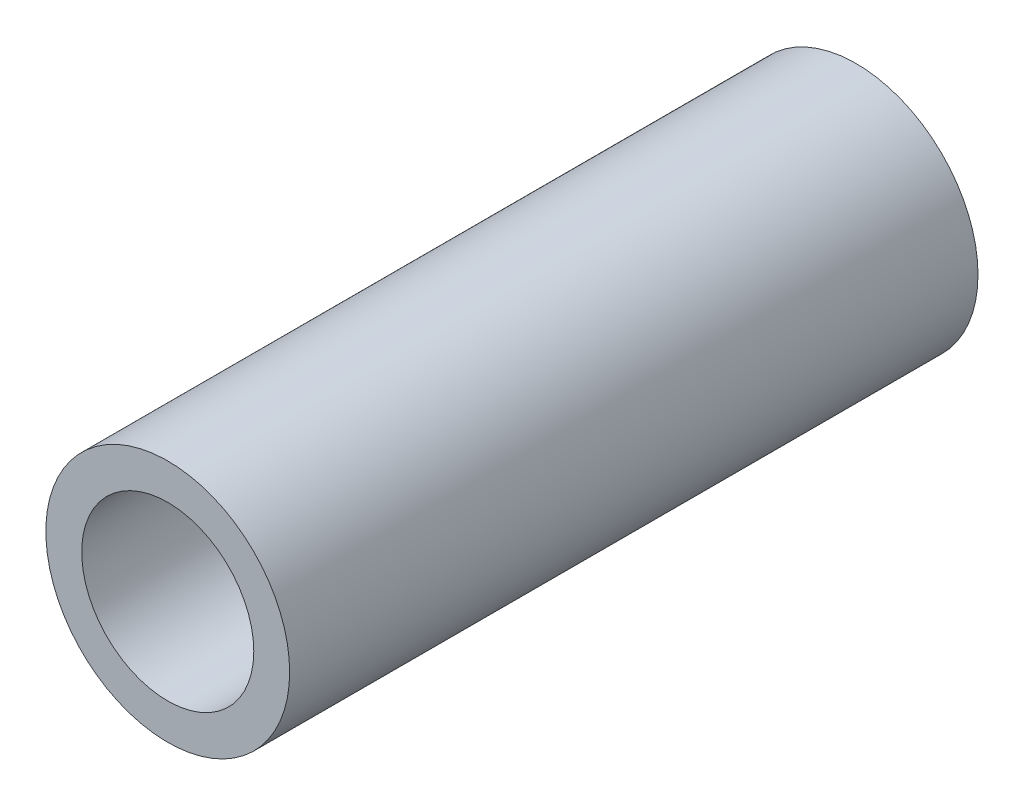
ISO-10303-21;
HEADER;
FILE_DESCRIPTION(('STEP AP214'),'2;1');
FILE_NAME('part.step','',(''),(''),'','','');
FILE_SCHEMA(('AUTOMOTIVE_DESIGN { 1 0 10303 214 1 1 1 1 }'));
ENDSEC;
DATA;
#1=APPLICATION_CONTEXT('core data for automotive mechanical design processes');
#2=APPLICATION_PROTOCOL_DEFINITION('international standard','automotive_design',2000,#1);
#3=PRODUCT_CONTEXT('',#1,'mechanical');
#4=PRODUCT('Part','Part','',(#3));
#5=PRODUCT_RELATED_PRODUCT_CATEGORY('part','',(#4));
#6=PRODUCT_DEFINITION_FORMATION('','',#4);
#7=PRODUCT_DEFINITION_CONTEXT('part definition',#1,'design');
#8=PRODUCT_DEFINITION('design','',#6,#7);
#9=PRODUCT_DEFINITION_SHAPE('','',#8);
#10=(LENGTH_UNIT() NAMED_UNIT(*) SI_UNIT(.MILLI.,.METRE.));
#11=(NAMED_UNIT(*) PLANE_ANGLE_UNIT() SI_UNIT($,.RADIAN.));
#12=(NAMED_UNIT(*) SI_UNIT($,.STERADIAN.) SOLID_ANGLE_UNIT());
#13=UNCERTAINTY_MEASURE_WITH_UNIT(LENGTH_MEASURE(1.E-05),#10,'distance_accuracy_value','');
#14=(GEOMETRIC_REPRESENTATION_CONTEXT(3) GLOBAL_UNCERTAINTY_ASSIGNED_CONTEXT((#13)) GLOBAL_UNIT_ASSIGNED_CONTEXT((#10,
#11,#12)) REPRESENTATION_CONTEXT('',''));
#15=CARTESIAN_POINT('',(0.,0.,0.));
#16=DIRECTION('',(0.,0.,1.));
#17=DIRECTION('',(1.,0.,0.));
#18=AXIS2_PLACEMENT_3D('',#15,#16,#17);
#19=CARTESIAN_POINT('',(0.,0.,0.));
#20=DIRECTION('',(0.,0.,1.));
#21=DIRECTION('',(1.,0.,0.));
#22=AXIS2_PLACEMENT_3D('',#19,#20,#21);
#23=PLANE('',#22);
#24=CARTESIAN_POINT('',(0.,0.,0.));
#25=DIRECTION('',(0.,0.,1.));
#26=DIRECTION('',(1.,0.,0.));
#27=AXIS2_PLACEMENT_3D('',#24,#25,#26);
#28=CIRCLE('',#27,9.525);
#29=CARTESIAN_POINT('',(9.525,0.,0.));
#30=VERTEX_POINT('',#29);
#31=EDGE_CURVE('E62',#30,#30,#28,.F.);
#32=ORIENTED_EDGE('',*,*,#31,.F.);
#33=EDGE_LOOP('',(#32));
#34=FACE_BOUND('',#33,.T.);
#35=CARTESIAN_POINT('',(0.,0.,0.));
#36=DIRECTION('',(0.,0.,1.));
#37=DIRECTION('',(1.,0.,0.));
#38=AXIS2_PLACEMENT_3D('',#35,#36,#37);
#39=CIRCLE('',#38,13.49375);
#40=CARTESIAN_POINT('',(13.49375,0.,0.));
#41=VERTEX_POINT('',#40);
#42=EDGE_CURVE('E54',#41,#41,#39,.T.);
#43=ORIENTED_EDGE('',*,*,#42,.F.);
#44=EDGE_LOOP('',(#43));
#45=FACE_BOUND('',#44,.T.);
#46=ADVANCED_FACE('F48',(#34,#45),#23,.F.);
#47=CARTESIAN_POINT('',(0.,0.,76.2));
#48=DIRECTION('',(0.,0.,1.));
#49=DIRECTION('',(1.,0.,0.));
#50=AXIS2_PLACEMENT_3D('',#47,#48,#49);
#51=PLANE('',#50);
#52=CARTESIAN_POINT('',(0.,0.,76.2));
#53=DIRECTION('',(0.,0.,1.));
#54=DIRECTION('',(1.,0.,0.));
#55=AXIS2_PLACEMENT_3D('',#52,#53,#54);
#56=CIRCLE('',#55,9.525);
#57=CARTESIAN_POINT('',(9.525,0.,76.2));
#58=VERTEX_POINT('',#57);
#59=EDGE_CURVE('E58',#58,#58,#56,.F.);
#60=ORIENTED_EDGE('',*,*,#59,.T.);
#61=EDGE_LOOP('',(#60));
#62=FACE_BOUND('',#61,.T.);
#63=CARTESIAN_POINT('',(0.,0.,76.2));
#64=DIRECTION('',(0.,0.,1.));
#65=DIRECTION('',(1.,0.,0.));
#66=AXIS2_PLACEMENT_3D('',#63,#64,#65);
#67=CIRCLE('',#66,13.49375);
#68=CARTESIAN_POINT('',(13.49375,0.,76.2));
#69=VERTEX_POINT('',#68);
#70=EDGE_CURVE('E11',#69,#69,#67,.T.);
#71=ORIENTED_EDGE('',*,*,#70,.T.);
#72=EDGE_LOOP('',(#71));
#73=FACE_BOUND('',#72,.T.);
#74=ADVANCED_FACE('F73',(#62,#73),#51,.T.);
#75=CARTESIAN_POINT('',(0.,0.,0.));
#76=DIRECTION('',(0.,0.,1.));
#77=DIRECTION('',(1.,0.,0.));
#78=AXIS2_PLACEMENT_3D('',#75,#76,#77);
#79=CYLINDRICAL_SURFACE('',#78,13.49375);
#80=ORIENTED_EDGE('',*,*,#70,.F.);
#81=EDGE_LOOP('',(#80));
#82=FACE_BOUND('',#81,.T.);
#83=ORIENTED_EDGE('',*,*,#42,.T.);
#84=EDGE_LOOP('',(#83));
#85=FACE_BOUND('',#84,.T.);
#86=ADVANCED_FACE('F77',(#82,#85),#79,.T.);
#87=CARTESIAN_POINT('',(0.,0.,-4.99999999999999));
#88=DIRECTION('',(0.,0.,1.));
#89=DIRECTION('',(1.,0.,0.));
#90=AXIS2_PLACEMENT_3D('',#87,#88,#89);
#91=CYLINDRICAL_SURFACE('',#90,9.525);
#92=ORIENTED_EDGE('',*,*,#31,.T.);
#93=EDGE_LOOP('',(#92));
#94=FACE_BOUND('',#93,.T.);
#95=ORIENTED_EDGE('',*,*,#59,.F.);
#96=EDGE_LOOP('',(#95));
#97=FACE_BOUND('',#96,.T.);
#98=ADVANCED_FACE('F68',(#94,#97),#91,.F.);
#99=CLOSED_SHELL('',(#46,#74,#86,#98));
#100=MANIFOLD_SOLID_BREP('B2',#99);
#101=ADVANCED_BREP_SHAPE_REPRESENTATION('',(#18,#100),#14);
#102=SHAPE_DEFINITION_REPRESENTATION(#9,#101);
ENDSEC;
END-ISO-10303-21;
